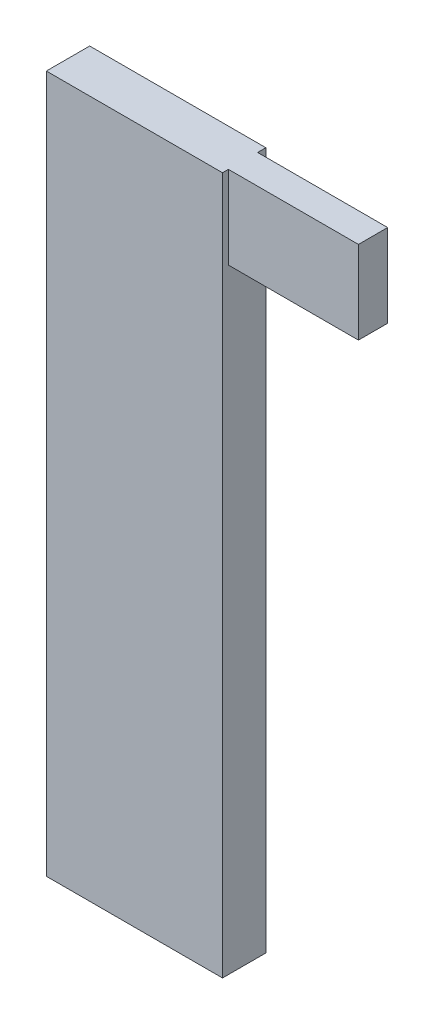
ISO-10303-21;
HEADER;
FILE_DESCRIPTION(('STEP AP214'),'2;1');
FILE_NAME('part.step','',(''),(''),'','','');
FILE_SCHEMA(('AUTOMOTIVE_DESIGN { 1 0 10303 214 1 1 1 1 }'));
ENDSEC;
DATA;
#1=APPLICATION_CONTEXT('core data for automotive mechanical design processes');
#2=APPLICATION_PROTOCOL_DEFINITION('international standard','automotive_design',2000,#1);
#3=PRODUCT_CONTEXT('',#1,'mechanical');
#4=PRODUCT('Part','Part','',(#3));
#5=PRODUCT_RELATED_PRODUCT_CATEGORY('part','',(#4));
#6=PRODUCT_DEFINITION_FORMATION('','',#4);
#7=PRODUCT_DEFINITION_CONTEXT('part definition',#1,'design');
#8=PRODUCT_DEFINITION('design','',#6,#7);
#9=PRODUCT_DEFINITION_SHAPE('','',#8);
#10=(LENGTH_UNIT() NAMED_UNIT(*) SI_UNIT(.MILLI.,.METRE.));
#11=(NAMED_UNIT(*) PLANE_ANGLE_UNIT() SI_UNIT($,.RADIAN.));
#12=(NAMED_UNIT(*) SI_UNIT($,.STERADIAN.) SOLID_ANGLE_UNIT());
#13=UNCERTAINTY_MEASURE_WITH_UNIT(LENGTH_MEASURE(1.E-05),#10,'distance_accuracy_value','');
#14=(GEOMETRIC_REPRESENTATION_CONTEXT(3) GLOBAL_UNCERTAINTY_ASSIGNED_CONTEXT((#13)) GLOBAL_UNIT_ASSIGNED_CONTEXT((#10,
#11,#12)) REPRESENTATION_CONTEXT('',''));
#15=CARTESIAN_POINT('',(0.,0.,0.));
#16=DIRECTION('',(0.,0.,1.));
#17=DIRECTION('',(1.,0.,0.));
#18=AXIS2_PLACEMENT_3D('',#15,#16,#17);
#19=CARTESIAN_POINT('',(-37.5648019739697,-2.3820263364277,1.27));
#20=DIRECTION('',(0.,1.,0.));
#21=DIRECTION('',(0.,0.,1.));
#22=AXIS2_PLACEMENT_3D('',#19,#20,#21);
#23=PLANE('',#22);
#24=DIRECTION('',(1.,0.,0.));
#25=VECTOR('',#24,1.);
#26=CARTESIAN_POINT('',(-37.5648019739697,-2.3820263364277,0.));
#27=LINE('',#26,#25);
#28=CARTESIAN_POINT('',(-37.5648019739697,-2.3820263364277,0.));
#29=VERTEX_POINT('',#28);
#30=CARTESIAN_POINT('',(-32.4024186657096,-2.3820263364277,0.));
#31=VERTEX_POINT('',#30);
#32=EDGE_CURVE('E194',#29,#31,#27,.T.);
#33=ORIENTED_EDGE('',*,*,#32,.T.);
#34=DIRECTION('',(0.,0.,-1.));
#35=VECTOR('',#34,1.);
#36=CARTESIAN_POINT('',(-32.4024186657096,-2.3820263364277,1.27));
#37=LINE('',#36,#35);
#38=CARTESIAN_POINT('',(-32.4024186657096,-2.3820263364277,1.27));
#39=VERTEX_POINT('',#38);
#40=EDGE_CURVE('E11',#39,#31,#37,.T.);
#41=ORIENTED_EDGE('',*,*,#40,.F.);
#42=DIRECTION('',(1.,0.,0.));
#43=VECTOR('',#42,1.);
#44=CARTESIAN_POINT('',(-37.5648019739697,-2.3820263364277,1.27));
#45=LINE('',#44,#43);
#46=CARTESIAN_POINT('',(-37.5648019739697,-2.3820263364277,1.27));
#47=VERTEX_POINT('',#46);
#48=EDGE_CURVE('E204',#47,#39,#45,.T.);
#49=ORIENTED_EDGE('',*,*,#48,.F.);
#50=DIRECTION('',(0.,0.,-1.));
#51=VECTOR('',#50,1.);
#52=CARTESIAN_POINT('',(-37.5648019739697,-2.3820263364277,1.27));
#53=LINE('',#52,#51);
#54=EDGE_CURVE('E218',#47,#29,#53,.T.);
#55=ORIENTED_EDGE('',*,*,#54,.T.);
#56=EDGE_LOOP('',(#33,#41,#49,#55));
#57=FACE_BOUND('',#56,.T.);
#58=ADVANCED_FACE('F39',(#57),#23,.F.);
#59=CARTESIAN_POINT('',(-32.4024186657096,18.0530258479316,1.27));
#60=DIRECTION('',(1.,0.,0.));
#61=DIRECTION('',(0.,0.,-1.));
#62=AXIS2_PLACEMENT_3D('',#59,#60,#61);
#63=PLANE('',#62);
#64=DIRECTION('',(0.,1.,0.));
#65=VECTOR('',#64,1.);
#66=CARTESIAN_POINT('',(-32.4024186657096,15.623511151766,0.240899256795884));
#67=LINE('',#66,#65);
#68=CARTESIAN_POINT('',(-32.4024186657096,15.623511151766,0.240899256795884));
#69=VERTEX_POINT('',#68);
#70=CARTESIAN_POINT('',(-32.4024186657096,18.0530258479316,0.240899256795884));
#71=VERTEX_POINT('',#70);
#72=EDGE_CURVE('E54',#69,#71,#67,.T.);
#73=ORIENTED_EDGE('',*,*,#72,.F.);
#74=DIRECTION('',(0.,0.,-1.));
#75=VECTOR('',#74,1.);
#76=CARTESIAN_POINT('',(-32.4024186657096,15.623511151766,1.09716218461883));
#77=LINE('',#76,#75);
#78=CARTESIAN_POINT('',(-32.4024186657096,15.623511151766,1.09716218461883));
#79=VERTEX_POINT('',#78);
#80=EDGE_CURVE('E257',#79,#69,#77,.T.);
#81=ORIENTED_EDGE('',*,*,#80,.F.);
#82=DIRECTION('',(0.,-1.,0.));
#83=VECTOR('',#82,1.);
#84=CARTESIAN_POINT('',(-32.4024186657096,18.0530258479316,1.09716218461883));
#85=LINE('',#84,#83);
#86=CARTESIAN_POINT('',(-32.4024186657096,18.0530258479316,1.09716218461883));
#87=VERTEX_POINT('',#86);
#88=EDGE_CURVE('E256',#87,#79,#85,.T.);
#89=ORIENTED_EDGE('',*,*,#88,.F.);
#90=DIRECTION('',(0.,0.,-1.));
#91=VECTOR('',#90,1.);
#92=CARTESIAN_POINT('',(-32.4024186657096,18.0530258479316,1.27));
#93=LINE('',#92,#91);
#94=CARTESIAN_POINT('',(-32.4024186657096,18.0530258479316,1.27));
#95=VERTEX_POINT('',#94);
#96=EDGE_CURVE('E47',#95,#87,#93,.T.);
#97=ORIENTED_EDGE('',*,*,#96,.F.);
#98=DIRECTION('',(0.,-1.,0.));
#99=VECTOR('',#98,1.);
#100=CARTESIAN_POINT('',(-32.4024186657096,18.0530258479316,1.27));
#101=LINE('',#100,#99);
#102=EDGE_CURVE('E207',#95,#39,#101,.T.);
#103=ORIENTED_EDGE('',*,*,#102,.T.);
#104=ORIENTED_EDGE('',*,*,#40,.T.);
#105=DIRECTION('',(0.,-1.,0.));
#106=VECTOR('',#105,1.);
#107=CARTESIAN_POINT('',(-32.4024186657096,18.0530258479316,0.));
#108=LINE('',#107,#106);
#109=CARTESIAN_POINT('',(-32.4024186657096,18.0530258479316,0.));
#110=VERTEX_POINT('',#109);
#111=EDGE_CURVE('E222',#110,#31,#108,.T.);
#112=ORIENTED_EDGE('',*,*,#111,.F.);
#113=EDGE_CURVE('E59',#71,#110,#93,.T.);
#114=ORIENTED_EDGE('',*,*,#113,.F.);
#115=EDGE_LOOP('',(#73,#81,#89,#97,#103,#104,#112,#114));
#116=FACE_BOUND('',#115,.T.);
#117=ADVANCED_FACE('F240',(#116),#63,.T.);
#118=CARTESIAN_POINT('',(-37.5648019739697,18.0530258479316,1.27));
#119=DIRECTION('',(0.,1.,0.));
#120=DIRECTION('',(0.,0.,1.));
#121=AXIS2_PLACEMENT_3D('',#118,#119,#120);
#122=PLANE('',#121);
#123=DIRECTION('',(1.,0.,0.));
#124=VECTOR('',#123,1.);
#125=CARTESIAN_POINT('',(-37.5648019739697,18.0530258479316,0.));
#126=LINE('',#125,#124);
#127=CARTESIAN_POINT('',(-37.5648019739697,18.0530258479316,0.));
#128=VERTEX_POINT('',#127);
#129=EDGE_CURVE('E226',#128,#110,#126,.T.);
#130=ORIENTED_EDGE('',*,*,#129,.F.);
#131=DIRECTION('',(0.,0.,-1.));
#132=VECTOR('',#131,1.);
#133=CARTESIAN_POINT('',(-37.5648019739697,18.0530258479316,1.27));
#134=LINE('',#133,#132);
#135=CARTESIAN_POINT('',(-37.5648019739697,18.0530258479316,1.27));
#136=VERTEX_POINT('',#135);
#137=EDGE_CURVE('E235',#136,#128,#134,.T.);
#138=ORIENTED_EDGE('',*,*,#137,.F.);
#139=DIRECTION('',(1.,0.,0.));
#140=VECTOR('',#139,1.);
#141=CARTESIAN_POINT('',(-37.5648019739697,18.0530258479316,1.27));
#142=LINE('',#141,#140);
#143=EDGE_CURVE('E212',#136,#95,#142,.T.);
#144=ORIENTED_EDGE('',*,*,#143,.T.);
#145=ORIENTED_EDGE('',*,*,#96,.T.);
#146=DIRECTION('',(-1.,0.,0.));
#147=VECTOR('',#146,1.);
#148=CARTESIAN_POINT('',(-28.5924186657096,18.0530258479316,1.09716218461883));
#149=LINE('',#148,#147);
#150=CARTESIAN_POINT('',(-28.5924186657096,18.0530258479316,1.09716218461883));
#151=VERTEX_POINT('',#150);
#152=EDGE_CURVE('E130',#151,#87,#149,.T.);
#153=ORIENTED_EDGE('',*,*,#152,.F.);
#154=DIRECTION('',(0.,0.,1.));
#155=VECTOR('',#154,1.);
#156=CARTESIAN_POINT('',(-28.5924186657096,18.0530258479316,0.240899256795884));
#157=LINE('',#156,#155);
#158=CARTESIAN_POINT('',(-28.5924186657096,18.0530258479316,0.240899256795884));
#159=VERTEX_POINT('',#158);
#160=EDGE_CURVE('E137',#159,#151,#157,.T.);
#161=ORIENTED_EDGE('',*,*,#160,.F.);
#162=DIRECTION('',(-1.,0.,0.));
#163=VECTOR('',#162,1.);
#164=CARTESIAN_POINT('',(-28.5924186657096,18.0530258479316,0.240899256795884));
#165=LINE('',#164,#163);
#166=EDGE_CURVE('E239',#159,#71,#165,.T.);
#167=ORIENTED_EDGE('',*,*,#166,.T.);
#168=ORIENTED_EDGE('',*,*,#113,.T.);
#169=EDGE_LOOP('',(#130,#138,#144,#145,#153,#161,#167,#168));
#170=FACE_BOUND('',#169,.T.);
#171=ADVANCED_FACE('F150',(#170),#122,.T.);
#172=CARTESIAN_POINT('',(-37.5648019739697,18.0530258479316,1.27));
#173=DIRECTION('',(1.,0.,0.));
#174=DIRECTION('',(0.,0.,-1.));
#175=AXIS2_PLACEMENT_3D('',#172,#173,#174);
#176=PLANE('',#175);
#177=DIRECTION('',(0.,0.,-1.));
#178=VECTOR('',#177,1.);
#179=CARTESIAN_POINT('',(-37.5648019739697,16.8739681908789,0.191724219646972));
#180=LINE('',#179,#178);
#181=CARTESIAN_POINT('',(-37.5648019739697,16.8739681908789,1.03065807070379));
#182=VERTEX_POINT('',#181);
#183=CARTESIAN_POINT('',(-37.5648019739697,16.8739681908789,0.191724219646972));
#184=VERTEX_POINT('',#183);
#185=EDGE_CURVE('E157',#182,#184,#180,.T.);
#186=ORIENTED_EDGE('',*,*,#185,.F.);
#187=DIRECTION('',(0.,1.,0.));
#188=VECTOR('',#187,1.);
#189=CARTESIAN_POINT('',(-37.5648019739697,16.8739681908789,1.03065807070379));
#190=LINE('',#189,#188);
#191=CARTESIAN_POINT('',(-37.5648019739697,12.9918277277312,1.03065807070379));
#192=VERTEX_POINT('',#191);
#193=EDGE_CURVE('E153',#192,#182,#190,.T.);
#194=ORIENTED_EDGE('',*,*,#193,.F.);
#195=DIRECTION('',(0.,0.,1.));
#196=VECTOR('',#195,1.);
#197=CARTESIAN_POINT('',(-37.5648019739697,12.9918277277312,0.191724219646972));
#198=LINE('',#197,#196);
#199=CARTESIAN_POINT('',(-37.5648019739697,12.9918277277312,0.191724219646972));
#200=VERTEX_POINT('',#199);
#201=EDGE_CURVE('E168',#200,#192,#198,.T.);
#202=ORIENTED_EDGE('',*,*,#201,.F.);
#203=DIRECTION('',(0.,-1.,0.));
#204=VECTOR('',#203,1.);
#205=CARTESIAN_POINT('',(-37.5648019739697,16.8739681908789,0.191724219646972));
#206=LINE('',#205,#204);
#207=EDGE_CURVE('E184',#184,#200,#206,.T.);
#208=ORIENTED_EDGE('',*,*,#207,.F.);
#209=EDGE_LOOP('',(#186,#194,#202,#208));
#210=FACE_BOUND('',#209,.T.);
#211=DIRECTION('',(0.,-1.,0.));
#212=VECTOR('',#211,1.);
#213=CARTESIAN_POINT('',(-37.5648019739697,18.0530258479316,0.));
#214=LINE('',#213,#212);
#215=EDGE_CURVE('E208',#128,#29,#214,.T.);
#216=ORIENTED_EDGE('',*,*,#215,.T.);
#217=ORIENTED_EDGE('',*,*,#54,.F.);
#218=DIRECTION('',(0.,-1.,0.));
#219=VECTOR('',#218,1.);
#220=CARTESIAN_POINT('',(-37.5648019739697,18.0530258479316,1.27));
#221=LINE('',#220,#219);
#222=EDGE_CURVE('E215',#136,#47,#221,.T.);
#223=ORIENTED_EDGE('',*,*,#222,.F.);
#224=ORIENTED_EDGE('',*,*,#137,.T.);
#225=EDGE_LOOP('',(#216,#217,#223,#224));
#226=FACE_BOUND('',#225,.T.);
#227=ADVANCED_FACE('F248',(#210,#226),#176,.F.);
#228=CARTESIAN_POINT('',(0.,0.,1.27));
#229=DIRECTION('',(0.,0.,-1.));
#230=DIRECTION('',(-1.,0.,0.));
#231=AXIS2_PLACEMENT_3D('',#228,#229,#230);
#232=PLANE('',#231);
#233=ORIENTED_EDGE('',*,*,#48,.T.);
#234=ORIENTED_EDGE('',*,*,#102,.F.);
#235=ORIENTED_EDGE('',*,*,#143,.F.);
#236=ORIENTED_EDGE('',*,*,#222,.T.);
#237=EDGE_LOOP('',(#233,#234,#235,#236));
#238=FACE_BOUND('',#237,.T.);
#239=ADVANCED_FACE('F254',(#238),#232,.F.);
#240=CARTESIAN_POINT('',(0.,0.,0.));
#241=DIRECTION('',(0.,0.,-1.));
#242=DIRECTION('',(-1.,0.,0.));
#243=AXIS2_PLACEMENT_3D('',#240,#241,#242);
#244=PLANE('',#243);
#245=ORIENTED_EDGE('',*,*,#32,.F.);
#246=ORIENTED_EDGE('',*,*,#215,.F.);
#247=ORIENTED_EDGE('',*,*,#129,.T.);
#248=ORIENTED_EDGE('',*,*,#111,.T.);
#249=EDGE_LOOP('',(#245,#246,#247,#248));
#250=FACE_BOUND('',#249,.T.);
#251=ADVANCED_FACE('F245',(#250),#244,.T.);
#252=CARTESIAN_POINT('',(-33.7548019739697,16.8739681908789,1.03065807070379));
#253=DIRECTION('',(0.,0.,1.));
#254=DIRECTION('',(1.,0.,0.));
#255=AXIS2_PLACEMENT_3D('',#252,#253,#254);
#256=PLANE('',#255);
#257=ORIENTED_EDGE('',*,*,#193,.T.);
#258=DIRECTION('',(-1.,0.,0.));
#259=VECTOR('',#258,1.);
#260=CARTESIAN_POINT('',(-33.7548019739697,16.8739681908789,1.03065807070379));
#261=LINE('',#260,#259);
#262=CARTESIAN_POINT('',(-33.7548019739697,16.8739681908789,1.03065807070379));
#263=VERTEX_POINT('',#262);
#264=EDGE_CURVE('E179',#263,#182,#261,.T.);
#265=ORIENTED_EDGE('',*,*,#264,.F.);
#266=DIRECTION('',(0.,1.,0.));
#267=VECTOR('',#266,1.);
#268=CARTESIAN_POINT('',(-33.7548019739697,16.8739681908789,1.03065807070379));
#269=LINE('',#268,#267);
#270=CARTESIAN_POINT('',(-33.7548019739697,12.9918277277312,1.03065807070379));
#271=VERTEX_POINT('',#270);
#272=EDGE_CURVE('E163',#271,#263,#269,.T.);
#273=ORIENTED_EDGE('',*,*,#272,.F.);
#274=DIRECTION('',(-1.,0.,0.));
#275=VECTOR('',#274,1.);
#276=CARTESIAN_POINT('',(-33.7548019739697,12.9918277277312,1.03065807070379));
#277=LINE('',#276,#275);
#278=EDGE_CURVE('E191',#271,#192,#277,.T.);
#279=ORIENTED_EDGE('',*,*,#278,.T.);
#280=EDGE_LOOP('',(#257,#265,#273,#279));
#281=FACE_BOUND('',#280,.T.);
#282=ADVANCED_FACE('F300',(#281),#256,.F.);
#283=CARTESIAN_POINT('',(-33.7548019739697,12.9918277277312,0.191724219646972));
#284=DIRECTION('',(0.,-1.,0.));
#285=DIRECTION('',(0.,0.,-1.));
#286=AXIS2_PLACEMENT_3D('',#283,#284,#285);
#287=PLANE('',#286);
#288=ORIENTED_EDGE('',*,*,#201,.T.);
#289=ORIENTED_EDGE('',*,*,#278,.F.);
#290=DIRECTION('',(0.,0.,1.));
#291=VECTOR('',#290,1.);
#292=CARTESIAN_POINT('',(-33.7548019739697,12.9918277277312,0.191724219646972));
#293=LINE('',#292,#291);
#294=CARTESIAN_POINT('',(-33.7548019739697,12.9918277277312,0.191724219646972));
#295=VERTEX_POINT('',#294);
#296=EDGE_CURVE('E176',#295,#271,#293,.T.);
#297=ORIENTED_EDGE('',*,*,#296,.F.);
#298=DIRECTION('',(-1.,0.,0.));
#299=VECTOR('',#298,1.);
#300=CARTESIAN_POINT('',(-33.7548019739697,12.9918277277312,0.191724219646972));
#301=LINE('',#300,#299);
#302=EDGE_CURVE('E195',#295,#200,#301,.T.);
#303=ORIENTED_EDGE('',*,*,#302,.T.);
#304=EDGE_LOOP('',(#288,#289,#297,#303));
#305=FACE_BOUND('',#304,.T.);
#306=ADVANCED_FACE('F305',(#305),#287,.F.);
#307=CARTESIAN_POINT('',(-33.7548019739697,16.8739681908789,0.191724219646972));
#308=DIRECTION('',(0.,0.,-1.));
#309=DIRECTION('',(-1.,0.,0.));
#310=AXIS2_PLACEMENT_3D('',#307,#308,#309);
#311=PLANE('',#310);
#312=ORIENTED_EDGE('',*,*,#207,.T.);
#313=ORIENTED_EDGE('',*,*,#302,.F.);
#314=DIRECTION('',(0.,-1.,0.));
#315=VECTOR('',#314,1.);
#316=CARTESIAN_POINT('',(-33.7548019739697,16.8739681908789,0.191724219646972));
#317=LINE('',#316,#315);
#318=CARTESIAN_POINT('',(-33.7548019739697,16.8739681908789,0.191724219646972));
#319=VERTEX_POINT('',#318);
#320=EDGE_CURVE('E172',#319,#295,#317,.T.);
#321=ORIENTED_EDGE('',*,*,#320,.F.);
#322=DIRECTION('',(-1.,0.,0.));
#323=VECTOR('',#322,1.);
#324=CARTESIAN_POINT('',(-33.7548019739697,16.8739681908789,0.191724219646972));
#325=LINE('',#324,#323);
#326=EDGE_CURVE('E198',#319,#184,#325,.T.);
#327=ORIENTED_EDGE('',*,*,#326,.T.);
#328=EDGE_LOOP('',(#312,#313,#321,#327));
#329=FACE_BOUND('',#328,.T.);
#330=ADVANCED_FACE('F310',(#329),#311,.F.);
#331=CARTESIAN_POINT('',(-33.7548019739697,16.8739681908789,0.191724219646972));
#332=DIRECTION('',(0.,1.,0.));
#333=DIRECTION('',(0.,0.,1.));
#334=AXIS2_PLACEMENT_3D('',#331,#332,#333);
#335=PLANE('',#334);
#336=ORIENTED_EDGE('',*,*,#185,.T.);
#337=ORIENTED_EDGE('',*,*,#326,.F.);
#338=DIRECTION('',(0.,0.,-1.));
#339=VECTOR('',#338,1.);
#340=CARTESIAN_POINT('',(-33.7548019739697,16.8739681908789,0.191724219646972));
#341=LINE('',#340,#339);
#342=EDGE_CURVE('E167',#263,#319,#341,.T.);
#343=ORIENTED_EDGE('',*,*,#342,.F.);
#344=ORIENTED_EDGE('',*,*,#264,.T.);
#345=EDGE_LOOP('',(#336,#337,#343,#344));
#346=FACE_BOUND('',#345,.T.);
#347=ADVANCED_FACE('F307',(#346),#335,.F.);
#348=CARTESIAN_POINT('',(-33.7548019739697,0.,0.));
#349=DIRECTION('',(-1.,0.,0.));
#350=DIRECTION('',(0.,0.,1.));
#351=AXIS2_PLACEMENT_3D('',#348,#349,#350);
#352=PLANE('',#351);
#353=ORIENTED_EDGE('',*,*,#272,.T.);
#354=ORIENTED_EDGE('',*,*,#342,.T.);
#355=ORIENTED_EDGE('',*,*,#320,.T.);
#356=ORIENTED_EDGE('',*,*,#296,.T.);
#357=EDGE_LOOP('',(#353,#354,#355,#356));
#358=FACE_BOUND('',#357,.T.);
#359=ADVANCED_FACE('F284',(#358),#352,.T.);
#360=CARTESIAN_POINT('',(-28.5924186657096,18.0530258479316,1.09716218461883));
#361=DIRECTION('',(0.,0.,-1.));
#362=DIRECTION('',(-1.,0.,0.));
#363=AXIS2_PLACEMENT_3D('',#360,#361,#362);
#364=PLANE('',#363);
#365=ORIENTED_EDGE('',*,*,#88,.T.);
#366=DIRECTION('',(-1.,0.,0.));
#367=VECTOR('',#366,1.);
#368=CARTESIAN_POINT('',(-28.5924186657096,15.623511151766,1.09716218461883));
#369=LINE('',#368,#367);
#370=CARTESIAN_POINT('',(-28.5924186657096,15.623511151766,1.09716218461883));
#371=VERTEX_POINT('',#370);
#372=EDGE_CURVE('E132',#371,#79,#369,.T.);
#373=ORIENTED_EDGE('',*,*,#372,.F.);
#374=DIRECTION('',(0.,-1.,0.));
#375=VECTOR('',#374,1.);
#376=CARTESIAN_POINT('',(-28.5924186657096,18.0530258479316,1.09716218461883));
#377=LINE('',#376,#375);
#378=EDGE_CURVE('E125',#151,#371,#377,.T.);
#379=ORIENTED_EDGE('',*,*,#378,.F.);
#380=ORIENTED_EDGE('',*,*,#152,.T.);
#381=EDGE_LOOP('',(#365,#373,#379,#380));
#382=FACE_BOUND('',#381,.T.);
#383=ADVANCED_FACE('F128',(#382),#364,.F.);
#384=CARTESIAN_POINT('',(-28.5924186657096,15.623511151766,1.09716218461883));
#385=DIRECTION('',(0.,1.,0.));
#386=DIRECTION('',(0.,0.,1.));
#387=AXIS2_PLACEMENT_3D('',#384,#385,#386);
#388=PLANE('',#387);
#389=ORIENTED_EDGE('',*,*,#80,.T.);
#390=DIRECTION('',(-1.,0.,0.));
#391=VECTOR('',#390,1.);
#392=CARTESIAN_POINT('',(-28.5924186657096,15.623511151766,0.240899256795884));
#393=LINE('',#392,#391);
#394=CARTESIAN_POINT('',(-28.5924186657096,15.623511151766,0.240899256795884));
#395=VERTEX_POINT('',#394);
#396=EDGE_CURVE('E159',#395,#69,#393,.T.);
#397=ORIENTED_EDGE('',*,*,#396,.F.);
#398=DIRECTION('',(0.,0.,-1.));
#399=VECTOR('',#398,1.);
#400=CARTESIAN_POINT('',(-28.5924186657096,15.623511151766,1.09716218461883));
#401=LINE('',#400,#399);
#402=EDGE_CURVE('E136',#371,#395,#401,.T.);
#403=ORIENTED_EDGE('',*,*,#402,.F.);
#404=ORIENTED_EDGE('',*,*,#372,.T.);
#405=EDGE_LOOP('',(#389,#397,#403,#404));
#406=FACE_BOUND('',#405,.T.);
#407=ADVANCED_FACE('F274',(#406),#388,.F.);
#408=CARTESIAN_POINT('',(-28.5924186657096,15.623511151766,0.240899256795884));
#409=DIRECTION('',(0.,0.,1.));
#410=DIRECTION('',(0.,-1.,0.));
#411=AXIS2_PLACEMENT_3D('',#408,#409,#410);
#412=PLANE('',#411);
#413=ORIENTED_EDGE('',*,*,#72,.T.);
#414=ORIENTED_EDGE('',*,*,#166,.F.);
#415=DIRECTION('',(0.,1.,0.));
#416=VECTOR('',#415,1.);
#417=CARTESIAN_POINT('',(-28.5924186657096,15.623511151766,0.240899256795884));
#418=LINE('',#417,#416);
#419=EDGE_CURVE('E142',#395,#159,#418,.T.);
#420=ORIENTED_EDGE('',*,*,#419,.F.);
#421=ORIENTED_EDGE('',*,*,#396,.T.);
#422=EDGE_LOOP('',(#413,#414,#420,#421));
#423=FACE_BOUND('',#422,.T.);
#424=ADVANCED_FACE('F272',(#423),#412,.F.);
#425=CARTESIAN_POINT('',(-28.5924186657096,0.,0.));
#426=DIRECTION('',(1.,0.,0.));
#427=DIRECTION('',(0.,0.,-1.));
#428=AXIS2_PLACEMENT_3D('',#425,#426,#427);
#429=PLANE('',#428);
#430=ORIENTED_EDGE('',*,*,#160,.T.);
#431=ORIENTED_EDGE('',*,*,#378,.T.);
#432=ORIENTED_EDGE('',*,*,#402,.T.);
#433=ORIENTED_EDGE('',*,*,#419,.T.);
#434=EDGE_LOOP('',(#430,#431,#432,#433));
#435=FACE_BOUND('',#434,.T.);
#436=ADVANCED_FACE('F140',(#435),#429,.T.);
#437=CLOSED_SHELL('',(#58,#117,#171,#227,#239,#251,#282,#306,#330,#347,#359,#383,#407,#424,#436));
#438=MANIFOLD_SOLID_BREP('B2',#437);
#439=ADVANCED_BREP_SHAPE_REPRESENTATION('',(#18,#438),#14);
#440=SHAPE_DEFINITION_REPRESENTATION(#9,#439);
ENDSEC;
END-ISO-10303-21;
